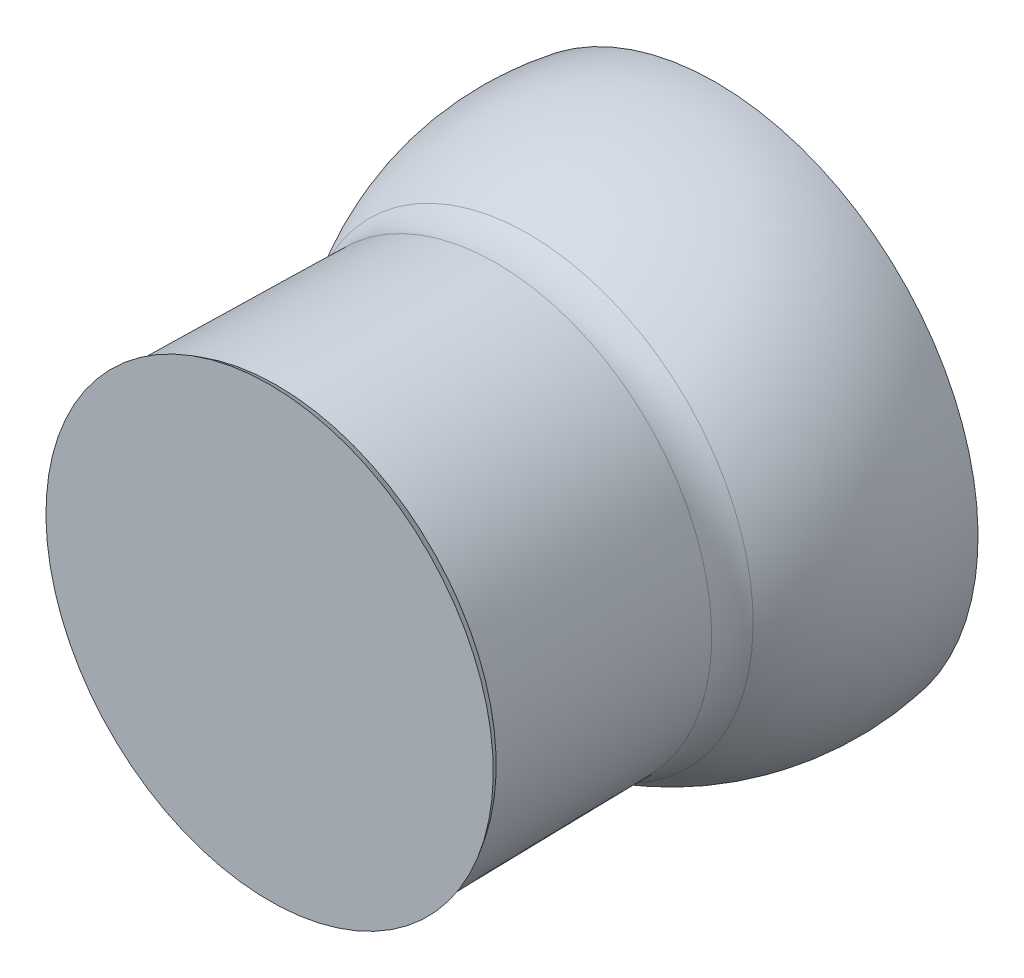
ISO-10303-21;
HEADER;
FILE_DESCRIPTION(('STEP AP214'),'2;1');
FILE_NAME('part.step','',(''),(''),'','','');
FILE_SCHEMA(('AUTOMOTIVE_DESIGN { 1 0 10303 214 1 1 1 1 }'));
ENDSEC;
DATA;
#1=APPLICATION_CONTEXT('core data for automotive mechanical design processes');
#2=APPLICATION_PROTOCOL_DEFINITION('international standard','automotive_design',2000,#1);
#3=PRODUCT_CONTEXT('',#1,'mechanical');
#4=PRODUCT('Part','Part','',(#3));
#5=PRODUCT_RELATED_PRODUCT_CATEGORY('part','',(#4));
#6=PRODUCT_DEFINITION_FORMATION('','',#4);
#7=PRODUCT_DEFINITION_CONTEXT('part definition',#1,'design');
#8=PRODUCT_DEFINITION('design','',#6,#7);
#9=PRODUCT_DEFINITION_SHAPE('','',#8);
#10=(LENGTH_UNIT() NAMED_UNIT(*) SI_UNIT(.MILLI.,.METRE.));
#11=(NAMED_UNIT(*) PLANE_ANGLE_UNIT() SI_UNIT($,.RADIAN.));
#12=(NAMED_UNIT(*) SI_UNIT($,.STERADIAN.) SOLID_ANGLE_UNIT());
#13=UNCERTAINTY_MEASURE_WITH_UNIT(LENGTH_MEASURE(1.E-05),#10,'distance_accuracy_value','');
#14=(GEOMETRIC_REPRESENTATION_CONTEXT(3) GLOBAL_UNCERTAINTY_ASSIGNED_CONTEXT((#13)) GLOBAL_UNIT_ASSIGNED_CONTEXT((#10,
#11,#12)) REPRESENTATION_CONTEXT('',''));
#15=CARTESIAN_POINT('',(0.,0.,0.));
#16=DIRECTION('',(0.,0.,1.));
#17=DIRECTION('',(1.,0.,0.));
#18=AXIS2_PLACEMENT_3D('',#15,#16,#17);
#19=CARTESIAN_POINT('',(0.,0.,6.14714548940946));
#20=DIRECTION('',(0.,0.,-1.));
#21=DIRECTION('',(0.,1.,0.));
#22=AXIS2_PLACEMENT_3D('',#19,#20,#21);
#23=SPHERICAL_SURFACE('',#22,36.4);
#24=CARTESIAN_POINT('',(0.,0.,25.637373582046));
#25=DIRECTION('',(0.,0.,-1.));
#26=DIRECTION('',(0.,1.,0.));
#27=AXIS2_PLACEMENT_3D('',#24,#25,#26);
#28=CIRCLE('',#27,30.7423325220615);
#29=CARTESIAN_POINT('',(0.,30.7423325220615,25.637373582046));
#30=VERTEX_POINT('',#29);
#31=EDGE_CURVE('E10',#30,#30,#28,.T.);
#32=ORIENTED_EDGE('',*,*,#31,.T.);
#33=EDGE_LOOP('',(#32));
#34=FACE_BOUND('',#33,.T.);
#35=CARTESIAN_POINT('',(0.,0.,0.));
#36=DIRECTION('',(0.,0.,-1.));
#37=DIRECTION('',(0.,1.,0.));
#38=AXIS2_PLACEMENT_3D('',#35,#36,#37);
#39=CIRCLE('',#38,35.8771877706717);
#40=CARTESIAN_POINT('',(0.,35.8771877706717,0.));
#41=VERTEX_POINT('',#40);
#42=EDGE_CURVE('E56',#41,#41,#39,.T.);
#43=ORIENTED_EDGE('',*,*,#42,.F.);
#44=EDGE_LOOP('',(#43));
#45=FACE_BOUND('',#44,.T.);
#46=ADVANCED_FACE('F37',(#34,#45),#23,.T.);
#47=CARTESIAN_POINT('',(0.,0.,29.9209401958123));
#48=DIRECTION('',(0.,0.,-1.));
#49=DIRECTION('',(0.,1.,0.));
#50=AXIS2_PLACEMENT_3D('',#47,#48,#49);
#51=TOROIDAL_SURFACE('',#50,37.4988891203168,8.00000000000001);
#52=CARTESIAN_POINT('',(0.,0.,30.0542550144842));
#53=DIRECTION('',(0.,0.,-1.));
#54=DIRECTION('',(0.,1.,0.));
#55=AXIS2_PLACEMENT_3D('',#52,#53,#54);
#56=CIRCLE('',#55,29.5);
#57=CARTESIAN_POINT('',(0.,29.5,30.0542550144842));
#58=VERTEX_POINT('',#57);
#59=EDGE_CURVE('E43',#58,#58,#56,.T.);
#60=ORIENTED_EDGE('',*,*,#59,.T.);
#61=EDGE_LOOP('',(#60));
#62=FACE_BOUND('',#61,.T.);
#63=ORIENTED_EDGE('',*,*,#31,.F.);
#64=EDGE_LOOP('',(#63));
#65=FACE_BOUND('',#64,.T.);
#66=ADVANCED_FACE('F63',(#62,#65),#51,.F.);
#67=CARTESIAN_POINT('',(0.,0.,30.0542550144842));
#68=DIRECTION('',(0.,0.,1.));
#69=DIRECTION('',(0.,-1.,0.));
#70=AXIS2_PLACEMENT_3D('',#67,#68,#69);
#71=CONICAL_SURFACE('',#70,29.5,0.0166651237139406);
#72=CARTESIAN_POINT('',(0.,0.,60.0542550144842));
#73=DIRECTION('',(0.,0.,-1.));
#74=DIRECTION('',(0.,1.,0.));
#75=AXIS2_PLACEMENT_3D('',#72,#73,#74);
#76=CIRCLE('',#75,30.);
#77=CARTESIAN_POINT('',(0.,30.,60.0542550144842));
#78=VERTEX_POINT('',#77);
#79=EDGE_CURVE('E47',#78,#78,#76,.T.);
#80=ORIENTED_EDGE('',*,*,#79,.T.);
#81=EDGE_LOOP('',(#80));
#82=FACE_BOUND('',#81,.T.);
#83=ORIENTED_EDGE('',*,*,#59,.F.);
#84=EDGE_LOOP('',(#83));
#85=FACE_BOUND('',#84,.T.);
#86=ADVANCED_FACE('F67',(#82,#85),#71,.T.);
#87=CARTESIAN_POINT('',(0.,0.,60.0542550144842));
#88=DIRECTION('',(0.,0.,1.));
#89=DIRECTION('',(0.,-1.,0.));
#90=AXIS2_PLACEMENT_3D('',#87,#88,#89);
#91=CONICAL_SURFACE('',#90,30.,0.540263899312245);
#92=CARTESIAN_POINT('',(0.,0.,61.0542550144842));
#93=DIRECTION('',(0.,0.,-1.));
#94=DIRECTION('',(0.,1.,0.));
#95=AXIS2_PLACEMENT_3D('',#92,#93,#94);
#96=CIRCLE('',#95,30.5997884024498);
#97=CARTESIAN_POINT('',(0.,30.5997884024498,61.0542550144842));
#98=VERTEX_POINT('',#97);
#99=EDGE_CURVE('E51',#98,#98,#96,.T.);
#100=ORIENTED_EDGE('',*,*,#99,.T.);
#101=EDGE_LOOP('',(#100));
#102=FACE_BOUND('',#101,.T.);
#103=ORIENTED_EDGE('',*,*,#79,.F.);
#104=EDGE_LOOP('',(#103));
#105=FACE_BOUND('',#104,.T.);
#106=ADVANCED_FACE('F71',(#102,#105),#91,.T.);
#107=CARTESIAN_POINT('',(0.,0.,61.0542550144842));
#108=DIRECTION('',(0.,0.,1.));
#109=DIRECTION('',(0.,-1.,0.));
#110=AXIS2_PLACEMENT_3D('',#107,#108,#109);
#111=PLANE('',#110);
#112=ORIENTED_EDGE('',*,*,#99,.F.);
#113=EDGE_LOOP('',(#112));
#114=FACE_BOUND('',#113,.T.);
#115=ADVANCED_FACE('F78',(#114),#111,.T.);
#116=CARTESIAN_POINT('',(0.,0.,0.));
#117=DIRECTION('',(0.,0.,1.));
#118=DIRECTION('',(0.,-1.,0.));
#119=AXIS2_PLACEMENT_3D('',#116,#117,#118);
#120=PLANE('',#119);
#121=ORIENTED_EDGE('',*,*,#42,.T.);
#122=EDGE_LOOP('',(#121));
#123=FACE_BOUND('',#122,.T.);
#124=ADVANCED_FACE('F60',(#123),#120,.F.);
#125=CLOSED_SHELL('',(#46,#66,#86,#106,#115,#124));
#126=MANIFOLD_SOLID_BREP('B2',#125);
#127=ADVANCED_BREP_SHAPE_REPRESENTATION('',(#18,#126),#14);
#128=SHAPE_DEFINITION_REPRESENTATION(#9,#127);
ENDSEC;
END-ISO-10303-21;
